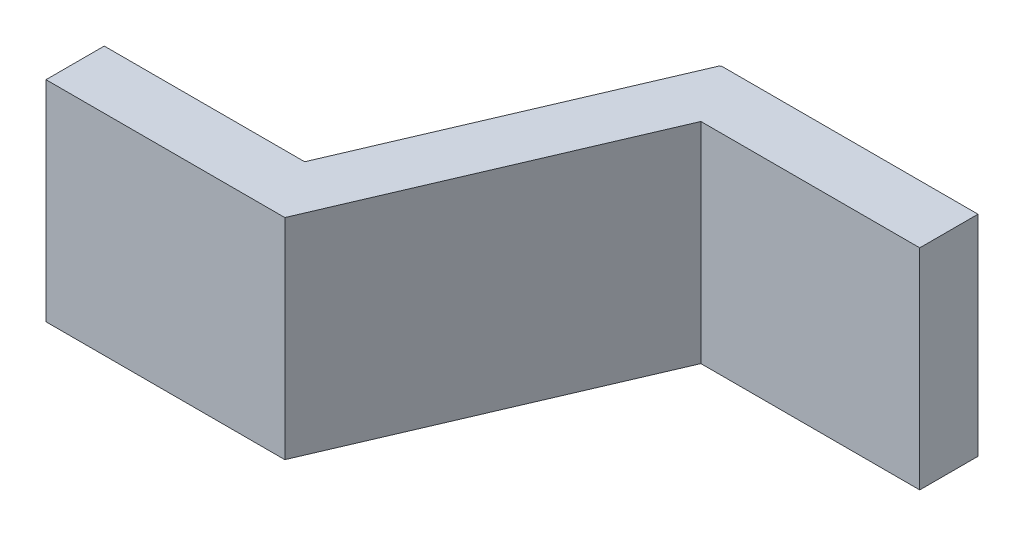
ISO-10303-21;
HEADER;
FILE_DESCRIPTION(('STEP AP214'),'2;1');
FILE_NAME('part.step','',(''),(''),'','','');
FILE_SCHEMA(('AUTOMOTIVE_DESIGN { 1 0 10303 214 1 1 1 1 }'));
ENDSEC;
DATA;
#1=APPLICATION_CONTEXT('core data for automotive mechanical design processes');
#2=APPLICATION_PROTOCOL_DEFINITION('international standard','automotive_design',2000,#1);
#3=PRODUCT_CONTEXT('',#1,'mechanical');
#4=PRODUCT('Part','Part','',(#3));
#5=PRODUCT_RELATED_PRODUCT_CATEGORY('part','',(#4));
#6=PRODUCT_DEFINITION_FORMATION('','',#4);
#7=PRODUCT_DEFINITION_CONTEXT('part definition',#1,'design');
#8=PRODUCT_DEFINITION('design','',#6,#7);
#9=PRODUCT_DEFINITION_SHAPE('','',#8);
#10=(LENGTH_UNIT() NAMED_UNIT(*) SI_UNIT(.MILLI.,.METRE.));
#11=(NAMED_UNIT(*) PLANE_ANGLE_UNIT() SI_UNIT($,.RADIAN.));
#12=(NAMED_UNIT(*) SI_UNIT($,.STERADIAN.) SOLID_ANGLE_UNIT());
#13=UNCERTAINTY_MEASURE_WITH_UNIT(LENGTH_MEASURE(1.E-05),#10,'distance_accuracy_value','');
#14=(GEOMETRIC_REPRESENTATION_CONTEXT(3) GLOBAL_UNCERTAINTY_ASSIGNED_CONTEXT((#13)) GLOBAL_UNIT_ASSIGNED_CONTEXT((#10,
#11,#12)) REPRESENTATION_CONTEXT('',''));
#15=CARTESIAN_POINT('',(0.,0.,0.));
#16=DIRECTION('',(0.,0.,1.));
#17=DIRECTION('',(1.,0.,0.));
#18=AXIS2_PLACEMENT_3D('',#15,#16,#17);
#19=CARTESIAN_POINT('',(11.558086453539,1.82,0.0006058345056003));
#20=DIRECTION('',(-0.919135450912914,0.,-0.393941649073963));
#21=DIRECTION('',(-0.393941649073963,0.,0.919135450912914));
#22=AXIS2_PLACEMENT_3D('',#19,#20,#21);
#23=PLANE('',#22);
#24=DIRECTION('',(0.,1.,0.));
#25=VECTOR('',#24,1.);
#26=CARTESIAN_POINT('',(11.344046008361,1.82,0.5));
#27=LINE('',#26,#25);
#28=CARTESIAN_POINT('',(11.344046008361,1.82,0.5));
#29=VERTEX_POINT('',#28);
#30=CARTESIAN_POINT('',(11.344046008361,2.180000014305,0.5));
#31=VERTEX_POINT('',#30);
#32=EDGE_CURVE('E94',#29,#31,#27,.T.);
#33=ORIENTED_EDGE('',*,*,#32,.T.);
#34=DIRECTION('',(-0.393941649073123,0.,0.919135450913275));
#35=VECTOR('',#34,1.);
#36=CARTESIAN_POINT('',(11.558086453539,2.180000014305,0.000605834505600302));
#37=LINE('',#36,#35);
#38=CARTESIAN_POINT('',(11.558086453539,2.180000014305,0.000605834505577237));
#39=VERTEX_POINT('',#38);
#40=EDGE_CURVE('E121',#39,#31,#37,.T.);
#41=ORIENTED_EDGE('',*,*,#40,.F.);
#42=DIRECTION('',(0.,1.,0.));
#43=VECTOR('',#42,1.);
#44=CARTESIAN_POINT('',(11.558086453539,1.82,0.000605834505554305));
#45=LINE('',#44,#43);
#46=CARTESIAN_POINT('',(11.558086453539,1.82,0.000605834505584969));
#47=VERTEX_POINT('',#46);
#48=EDGE_CURVE('E110',#39,#47,#45,.F.);
#49=ORIENTED_EDGE('',*,*,#48,.T.);
#50=DIRECTION('',(-0.393941649073123,0.,0.919135450913275));
#51=VECTOR('',#50,1.);
#52=CARTESIAN_POINT('',(11.558086453539,1.82,0.000605834505600302));
#53=LINE('',#52,#51);
#54=EDGE_CURVE('E100',#47,#29,#53,.T.);
#55=ORIENTED_EDGE('',*,*,#54,.T.);
#56=EDGE_LOOP('',(#33,#41,#49,#55));
#57=FACE_BOUND('',#56,.T.);
#58=ADVANCED_FACE('F17',(#57),#23,.T.);
#59=CARTESIAN_POINT('',(11.,1.82,0.5));
#60=DIRECTION('',(0.,0.,1.));
#61=DIRECTION('',(1.,0.,0.));
#62=AXIS2_PLACEMENT_3D('',#59,#60,#61);
#63=PLANE('',#62);
#64=DIRECTION('',(1.,0.,0.));
#65=VECTOR('',#64,1.);
#66=CARTESIAN_POINT('',(11.65,2.180000014305,0.5));
#67=LINE('',#66,#65);
#68=CARTESIAN_POINT('',(11.,2.180000014305,0.5));
#69=VERTEX_POINT('',#68);
#70=EDGE_CURVE('E79',#31,#69,#67,.F.);
#71=ORIENTED_EDGE('',*,*,#70,.F.);
#72=ORIENTED_EDGE('',*,*,#32,.F.);
#73=DIRECTION('',(1.,0.,0.));
#74=VECTOR('',#73,1.);
#75=CARTESIAN_POINT('',(11.65,1.82,0.5));
#76=LINE('',#75,#74);
#77=CARTESIAN_POINT('',(11.,1.82,0.5));
#78=VERTEX_POINT('',#77);
#79=EDGE_CURVE('E169',#29,#78,#76,.F.);
#80=ORIENTED_EDGE('',*,*,#79,.T.);
#81=DIRECTION('',(0.,1.,0.));
#82=VECTOR('',#81,1.);
#83=CARTESIAN_POINT('',(11.,1.82,0.5));
#84=LINE('',#83,#82);
#85=EDGE_CURVE('E87',#78,#69,#84,.T.);
#86=ORIENTED_EDGE('',*,*,#85,.T.);
#87=EDGE_LOOP('',(#71,#72,#80,#86));
#88=FACE_BOUND('',#87,.T.);
#89=ADVANCED_FACE('F198',(#88),#63,.F.);
#90=CARTESIAN_POINT('',(11.,1.82,0.5));
#91=DIRECTION('',(1.,0.,0.));
#92=DIRECTION('',(0.,0.,-1.));
#93=AXIS2_PLACEMENT_3D('',#90,#91,#92);
#94=PLANE('',#93);
#95=ORIENTED_EDGE('',*,*,#85,.F.);
#96=DIRECTION('',(0.,0.,1.));
#97=VECTOR('',#96,1.);
#98=CARTESIAN_POINT('',(11.,1.82,0.04));
#99=LINE('',#98,#97);
#100=CARTESIAN_POINT('',(11.,1.82,0.60000000149));
#101=VERTEX_POINT('',#100);
#102=EDGE_CURVE('E153',#78,#101,#99,.T.);
#103=ORIENTED_EDGE('',*,*,#102,.T.);
#104=DIRECTION('',(0.,1.,0.));
#105=VECTOR('',#104,1.);
#106=CARTESIAN_POINT('',(11.,1.82,0.60000000149));
#107=LINE('',#106,#105);
#108=CARTESIAN_POINT('',(11.,2.180000014305,0.60000000149));
#109=VERTEX_POINT('',#108);
#110=EDGE_CURVE('E117',#109,#101,#107,.F.);
#111=ORIENTED_EDGE('',*,*,#110,.F.);
#112=DIRECTION('',(0.,0.,1.));
#113=VECTOR('',#112,1.);
#114=CARTESIAN_POINT('',(11.,2.180000014305,0.04));
#115=LINE('',#114,#113);
#116=EDGE_CURVE('E71',#69,#109,#115,.T.);
#117=ORIENTED_EDGE('',*,*,#116,.F.);
#118=EDGE_LOOP('',(#95,#103,#111,#117));
#119=FACE_BOUND('',#118,.T.);
#120=ADVANCED_FACE('F202',(#119),#94,.F.);
#121=CARTESIAN_POINT('',(11.999999997616,1.82,0.));
#122=DIRECTION('',(1.,0.,0.));
#123=DIRECTION('',(0.,0.,-1.));
#124=AXIS2_PLACEMENT_3D('',#121,#122,#123);
#125=PLANE('',#124);
#126=DIRECTION('',(0.,0.,1.));
#127=VECTOR('',#126,1.);
#128=CARTESIAN_POINT('',(11.999999997616,1.82,0.04));
#129=LINE('',#128,#127);
#130=CARTESIAN_POINT('',(11.999999997616,1.82,0.10000000149));
#131=VERTEX_POINT('',#130);
#132=CARTESIAN_POINT('',(11.999999997616,1.82,0.));
#133=VERTEX_POINT('',#132);
#134=EDGE_CURVE('E179',#131,#133,#129,.F.);
#135=ORIENTED_EDGE('',*,*,#134,.T.);
#136=DIRECTION('',(0.,1.,0.));
#137=VECTOR('',#136,1.);
#138=CARTESIAN_POINT('',(11.999999997616,1.82,0.));
#139=LINE('',#138,#137);
#140=CARTESIAN_POINT('',(11.999999997616,2.180000014305,0.));
#141=VERTEX_POINT('',#140);
#142=EDGE_CURVE('E174',#133,#141,#139,.T.);
#143=ORIENTED_EDGE('',*,*,#142,.T.);
#144=DIRECTION('',(0.,0.,1.));
#145=VECTOR('',#144,1.);
#146=CARTESIAN_POINT('',(11.999999997616,2.180000014305,0.04));
#147=LINE('',#146,#145);
#148=CARTESIAN_POINT('',(11.999999997616,2.180000014305,0.10000000149));
#149=VERTEX_POINT('',#148);
#150=EDGE_CURVE('E155',#149,#141,#147,.F.);
#151=ORIENTED_EDGE('',*,*,#150,.F.);
#152=DIRECTION('',(0.,1.,0.));
#153=VECTOR('',#152,1.);
#154=CARTESIAN_POINT('',(11.999999997616,1.82,0.10000000149));
#155=LINE('',#154,#153);
#156=EDGE_CURVE('E125',#131,#149,#155,.T.);
#157=ORIENTED_EDGE('',*,*,#156,.F.);
#158=EDGE_LOOP('',(#135,#143,#151,#157));
#159=FACE_BOUND('',#158,.T.);
#160=ADVANCED_FACE('F228',(#159),#125,.T.);
#161=CARTESIAN_POINT('',(11.56,1.82,0.));
#162=DIRECTION('',(0.,0.,1.));
#163=DIRECTION('',(1.,0.,0.));
#164=AXIS2_PLACEMENT_3D('',#161,#162,#163);
#165=PLANE('',#164);
#166=DIRECTION('',(1.,0.,0.));
#167=VECTOR('',#166,1.);
#168=CARTESIAN_POINT('',(11.65,1.82,0.));
#169=LINE('',#168,#167);
#170=CARTESIAN_POINT('',(11.56,1.82,0.));
#171=VERTEX_POINT('',#170);
#172=EDGE_CURVE('E150',#133,#171,#169,.F.);
#173=ORIENTED_EDGE('',*,*,#172,.T.);
#174=DIRECTION('',(0.,1.,0.));
#175=VECTOR('',#174,1.);
#176=CARTESIAN_POINT('',(11.56,1.82,0.));
#177=LINE('',#176,#175);
#178=CARTESIAN_POINT('',(11.56,2.180000014305,0.));
#179=VERTEX_POINT('',#178);
#180=EDGE_CURVE('E164',#171,#179,#177,.T.);
#181=ORIENTED_EDGE('',*,*,#180,.T.);
#182=DIRECTION('',(1.,0.,0.));
#183=VECTOR('',#182,1.);
#184=CARTESIAN_POINT('',(11.65,2.180000014305,0.));
#185=LINE('',#184,#183);
#186=EDGE_CURVE('E154',#141,#179,#185,.F.);
#187=ORIENTED_EDGE('',*,*,#186,.F.);
#188=ORIENTED_EDGE('',*,*,#142,.F.);
#189=EDGE_LOOP('',(#173,#181,#187,#188));
#190=FACE_BOUND('',#189,.T.);
#191=ADVANCED_FACE('F232',(#190),#165,.F.);
#192=CARTESIAN_POINT('',(11.56,1.82,0.));
#193=DIRECTION('',(1.,0.,0.));
#194=DIRECTION('',(0.,0.,-1.));
#195=AXIS2_PLACEMENT_3D('',#192,#193,#194);
#196=PLANE('',#195);
#197=DIRECTION('',(0.,1.,0.));
#198=VECTOR('',#197,1.);
#199=CARTESIAN_POINT('',(11.56,1.82,0.00142598092431268));
#200=LINE('',#199,#198);
#201=CARTESIAN_POINT('',(11.56,1.82,0.00142598092431734));
#202=VERTEX_POINT('',#201);
#203=CARTESIAN_POINT('',(11.56,2.180000014305,0.00142598092431734));
#204=VERTEX_POINT('',#203);
#205=EDGE_CURVE('E118',#202,#204,#200,.T.);
#206=ORIENTED_EDGE('',*,*,#205,.T.);
#207=DIRECTION('',(0.,0.,1.));
#208=VECTOR('',#207,1.);
#209=CARTESIAN_POINT('',(11.56,2.180000014305,0.04));
#210=LINE('',#209,#208);
#211=EDGE_CURVE('E123',#179,#204,#210,.T.);
#212=ORIENTED_EDGE('',*,*,#211,.F.);
#213=ORIENTED_EDGE('',*,*,#180,.F.);
#214=DIRECTION('',(0.,0.,-1.));
#215=VECTOR('',#214,1.);
#216=CARTESIAN_POINT('',(11.56,1.82,0.));
#217=LINE('',#216,#215);
#218=EDGE_CURVE('E147',#171,#202,#217,.F.);
#219=ORIENTED_EDGE('',*,*,#218,.T.);
#220=EDGE_LOOP('',(#206,#212,#213,#219));
#221=FACE_BOUND('',#220,.T.);
#222=ADVANCED_FACE('F234',(#221),#196,.F.);
#223=CARTESIAN_POINT('',(11.65,1.82,0.04));
#224=DIRECTION('',(-0.393941649073963,0.,0.919135450912914));
#225=DIRECTION('',(0.919135450912914,0.,0.393941649073963));
#226=AXIS2_PLACEMENT_3D('',#223,#224,#225);
#227=PLANE('',#226);
#228=DIRECTION('',(-0.919135450920459,0.,-0.393941649056361));
#229=VECTOR('',#228,1.);
#230=CARTESIAN_POINT('',(11.56,2.180000014305,0.001425980924322));
#231=LINE('',#230,#229);
#232=EDGE_CURVE('E113',#204,#39,#231,.T.);
#233=ORIENTED_EDGE('',*,*,#232,.F.);
#234=ORIENTED_EDGE('',*,*,#205,.F.);
#235=DIRECTION('',(-0.919135450920459,0.,-0.393941649056361));
#236=VECTOR('',#235,1.);
#237=CARTESIAN_POINT('',(11.56,1.82,0.001425980924322));
#238=LINE('',#237,#236);
#239=EDGE_CURVE('E114',#202,#47,#238,.T.);
#240=ORIENTED_EDGE('',*,*,#239,.T.);
#241=ORIENTED_EDGE('',*,*,#48,.F.);
#242=EDGE_LOOP('',(#233,#234,#240,#241));
#243=FACE_BOUND('',#242,.T.);
#244=ADVANCED_FACE('F112',(#243),#227,.F.);
#245=CARTESIAN_POINT('',(11.,1.82,0.60000000149));
#246=DIRECTION('',(0.,0.,1.));
#247=DIRECTION('',(1.,0.,0.));
#248=AXIS2_PLACEMENT_3D('',#245,#246,#247);
#249=PLANE('',#248);
#250=DIRECTION('',(0.,1.,0.));
#251=VECTOR('',#250,1.);
#252=CARTESIAN_POINT('',(11.4099838806682,1.82,0.60000000149));
#253=LINE('',#252,#251);
#254=CARTESIAN_POINT('',(11.4099838806682,1.82,0.60000000149));
#255=VERTEX_POINT('',#254);
#256=CARTESIAN_POINT('',(11.4099838806682,2.180000014305,0.60000000149));
#257=VERTEX_POINT('',#256);
#258=EDGE_CURVE('E144',#255,#257,#253,.T.);
#259=ORIENTED_EDGE('',*,*,#258,.T.);
#260=DIRECTION('',(1.,0.,0.));
#261=VECTOR('',#260,1.);
#262=CARTESIAN_POINT('',(11.65,2.180000014305,0.60000000149));
#263=LINE('',#262,#261);
#264=EDGE_CURVE('E20',#109,#257,#263,.T.);
#265=ORIENTED_EDGE('',*,*,#264,.F.);
#266=ORIENTED_EDGE('',*,*,#110,.T.);
#267=DIRECTION('',(1.,0.,0.));
#268=VECTOR('',#267,1.);
#269=CARTESIAN_POINT('',(11.,1.82,0.60000000149));
#270=LINE('',#269,#268);
#271=EDGE_CURVE('E151',#101,#255,#270,.T.);
#272=ORIENTED_EDGE('',*,*,#271,.T.);
#273=EDGE_LOOP('',(#259,#265,#266,#272));
#274=FACE_BOUND('',#273,.T.);
#275=ADVANCED_FACE('F205',(#274),#249,.T.);
#276=CARTESIAN_POINT('',(11.65,2.180000014305,0.04));
#277=DIRECTION('',(0.,1.,0.));
#278=DIRECTION('',(0.,0.,1.));
#279=AXIS2_PLACEMENT_3D('',#276,#277,#278);
#280=PLANE('',#279);
#281=ORIENTED_EDGE('',*,*,#211,.T.);
#282=ORIENTED_EDGE('',*,*,#232,.T.);
#283=ORIENTED_EDGE('',*,*,#40,.T.);
#284=ORIENTED_EDGE('',*,*,#70,.T.);
#285=ORIENTED_EDGE('',*,*,#116,.T.);
#286=ORIENTED_EDGE('',*,*,#264,.T.);
#287=DIRECTION('',(-0.393941649073964,0.,0.919135450912914));
#288=VECTOR('',#287,1.);
#289=CARTESIAN_POINT('',(11.6242839866442,2.180000014305,0.100000001490094));
#290=LINE('',#289,#288);
#291=CARTESIAN_POINT('',(11.6242839866442,2.180000014305,0.100000001490047));
#292=VERTEX_POINT('',#291);
#293=EDGE_CURVE('E141',#257,#292,#290,.F.);
#294=ORIENTED_EDGE('',*,*,#293,.T.);
#295=DIRECTION('',(1.,0.,0.));
#296=VECTOR('',#295,1.);
#297=CARTESIAN_POINT('',(11.56,2.180000014305,0.10000000149));
#298=LINE('',#297,#296);
#299=EDGE_CURVE('E170',#149,#292,#298,.F.);
#300=ORIENTED_EDGE('',*,*,#299,.F.);
#301=ORIENTED_EDGE('',*,*,#150,.T.);
#302=ORIENTED_EDGE('',*,*,#186,.T.);
#303=EDGE_LOOP('',(#281,#282,#283,#284,#285,#286,#294,#300,#301,#302));
#304=FACE_BOUND('',#303,.T.);
#305=ADVANCED_FACE('F120',(#304),#280,.T.);
#306=CARTESIAN_POINT('',(11.56,1.82,0.10000000149));
#307=DIRECTION('',(0.,0.,1.));
#308=DIRECTION('',(1.,0.,0.));
#309=AXIS2_PLACEMENT_3D('',#306,#307,#308);
#310=PLANE('',#309);
#311=ORIENTED_EDGE('',*,*,#299,.T.);
#312=DIRECTION('',(0.,1.,0.));
#313=VECTOR('',#312,1.);
#314=CARTESIAN_POINT('',(11.6242839866442,1.82,0.100000001490094));
#315=LINE('',#314,#313);
#316=CARTESIAN_POINT('',(11.6242839866442,1.82,0.100000001490047));
#317=VERTEX_POINT('',#316);
#318=EDGE_CURVE('E26',#292,#317,#315,.F.);
#319=ORIENTED_EDGE('',*,*,#318,.T.);
#320=DIRECTION('',(1.,0.,0.));
#321=VECTOR('',#320,1.);
#322=CARTESIAN_POINT('',(11.65,1.82,0.10000000149));
#323=LINE('',#322,#321);
#324=EDGE_CURVE('E34',#317,#131,#323,.T.);
#325=ORIENTED_EDGE('',*,*,#324,.T.);
#326=ORIENTED_EDGE('',*,*,#156,.T.);
#327=EDGE_LOOP('',(#311,#319,#325,#326));
#328=FACE_BOUND('',#327,.T.);
#329=ADVANCED_FACE('F223',(#328),#310,.T.);
#330=CARTESIAN_POINT('',(11.65,1.82,0.04));
#331=DIRECTION('',(0.,1.,0.));
#332=DIRECTION('',(0.,0.,1.));
#333=AXIS2_PLACEMENT_3D('',#330,#331,#332);
#334=PLANE('',#333);
#335=ORIENTED_EDGE('',*,*,#218,.F.);
#336=ORIENTED_EDGE('',*,*,#172,.F.);
#337=ORIENTED_EDGE('',*,*,#134,.F.);
#338=ORIENTED_EDGE('',*,*,#324,.F.);
#339=DIRECTION('',(0.393941649073964,0.,-0.919135450912914));
#340=VECTOR('',#339,1.);
#341=CARTESIAN_POINT('',(11.4098164411035,1.82,0.600390667570103));
#342=LINE('',#341,#340);
#343=EDGE_CURVE('E11',#317,#255,#342,.F.);
#344=ORIENTED_EDGE('',*,*,#343,.T.);
#345=ORIENTED_EDGE('',*,*,#271,.F.);
#346=ORIENTED_EDGE('',*,*,#102,.F.);
#347=ORIENTED_EDGE('',*,*,#79,.F.);
#348=ORIENTED_EDGE('',*,*,#54,.F.);
#349=ORIENTED_EDGE('',*,*,#239,.F.);
#350=EDGE_LOOP('',(#335,#336,#337,#338,#344,#345,#346,#347,#348,#349));
#351=FACE_BOUND('',#350,.T.);
#352=ADVANCED_FACE('F200',(#351),#334,.F.);
#353=CARTESIAN_POINT('',(11.65,1.82,0.04));
#354=DIRECTION('',(-0.919135450912914,0.,-0.393941649073963));
#355=DIRECTION('',(-0.393941649073963,0.,0.919135450912914));
#356=AXIS2_PLACEMENT_3D('',#353,#354,#355);
#357=PLANE('',#356);
#358=ORIENTED_EDGE('',*,*,#318,.F.);
#359=ORIENTED_EDGE('',*,*,#293,.F.);
#360=ORIENTED_EDGE('',*,*,#258,.F.);
#361=ORIENTED_EDGE('',*,*,#343,.F.);
#362=EDGE_LOOP('',(#358,#359,#360,#361));
#363=FACE_BOUND('',#362,.T.);
#364=ADVANCED_FACE('F210',(#363),#357,.F.);
#365=CLOSED_SHELL('',(#58,#89,#120,#160,#191,#222,#244,#275,#305,#329,#352,#364));
#366=MANIFOLD_SOLID_BREP('B1',#365);
#367=ADVANCED_BREP_SHAPE_REPRESENTATION('',(#18,#366),#14);
#368=SHAPE_DEFINITION_REPRESENTATION(#9,#367);
ENDSEC;
END-ISO-10303-21;
